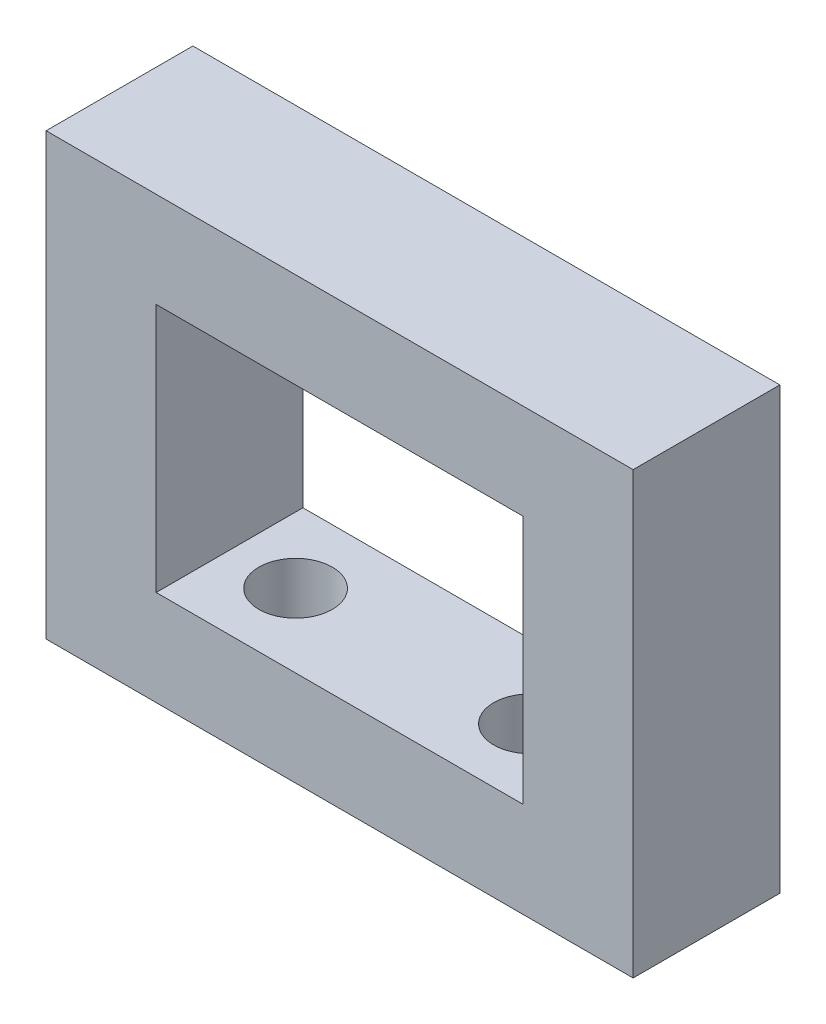
ISO-10303-21;
HEADER;
FILE_DESCRIPTION(('STEP AP214'),'2;1');
FILE_NAME('part.step','',(''),(''),'','','');
FILE_SCHEMA(('AUTOMOTIVE_DESIGN { 1 0 10303 214 1 1 1 1 }'));
ENDSEC;
DATA;
#1=APPLICATION_CONTEXT('core data for automotive mechanical design processes');
#2=APPLICATION_PROTOCOL_DEFINITION('international standard','automotive_design',2000,#1);
#3=PRODUCT_CONTEXT('',#1,'mechanical');
#4=PRODUCT('Part','Part','',(#3));
#5=PRODUCT_RELATED_PRODUCT_CATEGORY('part','',(#4));
#6=PRODUCT_DEFINITION_FORMATION('','',#4);
#7=PRODUCT_DEFINITION_CONTEXT('part definition',#1,'design');
#8=PRODUCT_DEFINITION('design','',#6,#7);
#9=PRODUCT_DEFINITION_SHAPE('','',#8);
#10=(LENGTH_UNIT() NAMED_UNIT(*) SI_UNIT(.MILLI.,.METRE.));
#11=(NAMED_UNIT(*) PLANE_ANGLE_UNIT() SI_UNIT($,.RADIAN.));
#12=(NAMED_UNIT(*) SI_UNIT($,.STERADIAN.) SOLID_ANGLE_UNIT());
#13=UNCERTAINTY_MEASURE_WITH_UNIT(LENGTH_MEASURE(1.E-05),#10,'distance_accuracy_value','');
#14=(GEOMETRIC_REPRESENTATION_CONTEXT(3) GLOBAL_UNCERTAINTY_ASSIGNED_CONTEXT((#13)) GLOBAL_UNIT_ASSIGNED_CONTEXT((#10,
#11,#12)) REPRESENTATION_CONTEXT('',''));
#15=CARTESIAN_POINT('',(0.,0.,0.));
#16=DIRECTION('',(0.,0.,1.));
#17=DIRECTION('',(1.,0.,0.));
#18=AXIS2_PLACEMENT_3D('',#15,#16,#17);
#19=CARTESIAN_POINT('',(10.,-7.5,2.5));
#20=DIRECTION('',(-1.,0.,0.));
#21=DIRECTION('',(0.,0.,1.));
#22=AXIS2_PLACEMENT_3D('',#19,#20,#21);
#23=PLANE('',#22);
#24=DIRECTION('',(0.,1.,0.));
#25=VECTOR('',#24,1.);
#26=CARTESIAN_POINT('',(10.,-7.5,-2.5));
#27=LINE('',#26,#25);
#28=CARTESIAN_POINT('',(10.,-7.5,-2.5));
#29=VERTEX_POINT('',#28);
#30=CARTESIAN_POINT('',(10.,7.5,-2.5));
#31=VERTEX_POINT('',#30);
#32=EDGE_CURVE('E134',#29,#31,#27,.T.);
#33=ORIENTED_EDGE('',*,*,#32,.T.);
#34=DIRECTION('',(0.,0.,-1.));
#35=VECTOR('',#34,1.);
#36=CARTESIAN_POINT('',(10.,7.5,2.5));
#37=LINE('',#36,#35);
#38=CARTESIAN_POINT('',(10.,7.5,2.5));
#39=VERTEX_POINT('',#38);
#40=EDGE_CURVE('E11',#39,#31,#37,.T.);
#41=ORIENTED_EDGE('',*,*,#40,.F.);
#42=DIRECTION('',(0.,1.,0.));
#43=VECTOR('',#42,1.);
#44=CARTESIAN_POINT('',(10.,-7.5,2.5));
#45=LINE('',#44,#43);
#46=CARTESIAN_POINT('',(10.,-7.5,2.5));
#47=VERTEX_POINT('',#46);
#48=EDGE_CURVE('E138',#47,#39,#45,.T.);
#49=ORIENTED_EDGE('',*,*,#48,.F.);
#50=DIRECTION('',(0.,0.,-1.));
#51=VECTOR('',#50,1.);
#52=CARTESIAN_POINT('',(10.,-7.5,2.5));
#53=LINE('',#52,#51);
#54=EDGE_CURVE('E148',#47,#29,#53,.T.);
#55=ORIENTED_EDGE('',*,*,#54,.T.);
#56=EDGE_LOOP('',(#33,#41,#49,#55));
#57=FACE_BOUND('',#56,.T.);
#58=ADVANCED_FACE('F33',(#57),#23,.F.);
#59=CARTESIAN_POINT('',(-9.99999999999999,7.5,2.5));
#60=DIRECTION('',(0.,-1.,0.));
#61=DIRECTION('',(0.,0.,-1.));
#62=AXIS2_PLACEMENT_3D('',#59,#60,#61);
#63=PLANE('',#62);
#64=DIRECTION('',(-1.,0.,0.));
#65=VECTOR('',#64,1.);
#66=CARTESIAN_POINT('',(-9.99999999999999,7.5,-2.5));
#67=LINE('',#66,#65);
#68=CARTESIAN_POINT('',(-9.99999999999999,7.5,-2.5));
#69=VERTEX_POINT('',#68);
#70=EDGE_CURVE('E151',#31,#69,#67,.T.);
#71=ORIENTED_EDGE('',*,*,#70,.T.);
#72=DIRECTION('',(0.,0.,-1.));
#73=VECTOR('',#72,1.);
#74=CARTESIAN_POINT('',(-9.99999999999999,7.5,2.5));
#75=LINE('',#74,#73);
#76=CARTESIAN_POINT('',(-9.99999999999999,7.5,2.5));
#77=VERTEX_POINT('',#76);
#78=EDGE_CURVE('E40',#77,#69,#75,.T.);
#79=ORIENTED_EDGE('',*,*,#78,.F.);
#80=DIRECTION('',(-1.,0.,0.));
#81=VECTOR('',#80,1.);
#82=CARTESIAN_POINT('',(-9.99999999999999,7.5,2.5));
#83=LINE('',#82,#81);
#84=EDGE_CURVE('E141',#39,#77,#83,.T.);
#85=ORIENTED_EDGE('',*,*,#84,.F.);
#86=ORIENTED_EDGE('',*,*,#40,.T.);
#87=EDGE_LOOP('',(#71,#79,#85,#86));
#88=FACE_BOUND('',#87,.T.);
#89=ADVANCED_FACE('F179',(#88),#63,.F.);
#90=CARTESIAN_POINT('',(-9.99999999999999,-7.5,2.5));
#91=DIRECTION('',(1.,0.,0.));
#92=DIRECTION('',(0.,0.,-1.));
#93=AXIS2_PLACEMENT_3D('',#90,#91,#92);
#94=PLANE('',#93);
#95=DIRECTION('',(0.,-1.,0.));
#96=VECTOR('',#95,1.);
#97=CARTESIAN_POINT('',(-9.99999999999999,-7.5,-2.5));
#98=LINE('',#97,#96);
#99=CARTESIAN_POINT('',(-9.99999999999999,-7.5,-2.5));
#100=VERTEX_POINT('',#99);
#101=EDGE_CURVE('E153',#69,#100,#98,.T.);
#102=ORIENTED_EDGE('',*,*,#101,.T.);
#103=DIRECTION('',(0.,0.,-1.));
#104=VECTOR('',#103,1.);
#105=CARTESIAN_POINT('',(-9.99999999999999,-7.5,2.5));
#106=LINE('',#105,#104);
#107=CARTESIAN_POINT('',(-9.99999999999999,-7.5,2.5));
#108=VERTEX_POINT('',#107);
#109=EDGE_CURVE('E158',#108,#100,#106,.T.);
#110=ORIENTED_EDGE('',*,*,#109,.F.);
#111=DIRECTION('',(0.,-1.,0.));
#112=VECTOR('',#111,1.);
#113=CARTESIAN_POINT('',(-9.99999999999999,-7.5,2.5));
#114=LINE('',#113,#112);
#115=EDGE_CURVE('E144',#77,#108,#114,.T.);
#116=ORIENTED_EDGE('',*,*,#115,.F.);
#117=ORIENTED_EDGE('',*,*,#78,.T.);
#118=EDGE_LOOP('',(#102,#110,#116,#117));
#119=FACE_BOUND('',#118,.T.);
#120=ADVANCED_FACE('F165',(#119),#94,.F.);
#121=CARTESIAN_POINT('',(-9.99999999999999,-7.5,2.5));
#122=DIRECTION('',(0.,1.,0.));
#123=DIRECTION('',(0.,0.,1.));
#124=AXIS2_PLACEMENT_3D('',#121,#122,#123);
#125=PLANE('',#124);
#126=CARTESIAN_POINT('',(-4.,-7.5,0.));
#127=DIRECTION('',(0.,-1.,0.));
#128=DIRECTION('',(0.,0.,-1.));
#129=AXIS2_PLACEMENT_3D('',#126,#127,#128);
#130=CIRCLE('',#129,1.25);
#131=CARTESIAN_POINT('',(-4.,-7.5,-1.25));
#132=VERTEX_POINT('',#131);
#133=EDGE_CURVE('E218',#132,#132,#130,.T.);
#134=ORIENTED_EDGE('',*,*,#133,.F.);
#135=EDGE_LOOP('',(#134));
#136=FACE_BOUND('',#135,.T.);
#137=CARTESIAN_POINT('',(4.,-7.5,0.));
#138=DIRECTION('',(0.,-1.,0.));
#139=DIRECTION('',(0.,0.,-1.));
#140=AXIS2_PLACEMENT_3D('',#137,#138,#139);
#141=CIRCLE('',#140,1.25);
#142=CARTESIAN_POINT('',(4.,-7.5,-1.25));
#143=VERTEX_POINT('',#142);
#144=EDGE_CURVE('E223',#143,#143,#141,.T.);
#145=ORIENTED_EDGE('',*,*,#144,.F.);
#146=EDGE_LOOP('',(#145));
#147=FACE_BOUND('',#146,.T.);
#148=DIRECTION('',(1.,0.,0.));
#149=VECTOR('',#148,1.);
#150=CARTESIAN_POINT('',(-9.99999999999999,-7.5,-2.5));
#151=LINE('',#150,#149);
#152=EDGE_CURVE('E142',#100,#29,#151,.T.);
#153=ORIENTED_EDGE('',*,*,#152,.T.);
#154=ORIENTED_EDGE('',*,*,#54,.F.);
#155=DIRECTION('',(1.,0.,0.));
#156=VECTOR('',#155,1.);
#157=CARTESIAN_POINT('',(-9.99999999999999,-7.5,2.5));
#158=LINE('',#157,#156);
#159=EDGE_CURVE('E146',#108,#47,#158,.T.);
#160=ORIENTED_EDGE('',*,*,#159,.F.);
#161=ORIENTED_EDGE('',*,*,#109,.T.);
#162=EDGE_LOOP('',(#153,#154,#160,#161));
#163=FACE_BOUND('',#162,.T.);
#164=ADVANCED_FACE('F172',(#136,#147,#163),#125,.F.);
#165=CARTESIAN_POINT('',(0.,0.,2.5));
#166=DIRECTION('',(0.,0.,-1.));
#167=DIRECTION('',(-1.,0.,0.));
#168=AXIS2_PLACEMENT_3D('',#165,#166,#167);
#169=PLANE('',#168);
#170=DIRECTION('',(-1.,0.,0.));
#171=VECTOR('',#170,1.);
#172=CARTESIAN_POINT('',(-6.25,4.25,2.5));
#173=LINE('',#172,#171);
#174=CARTESIAN_POINT('',(6.25,4.25,2.5));
#175=VERTEX_POINT('',#174);
#176=CARTESIAN_POINT('',(-6.25,4.25,2.5));
#177=VERTEX_POINT('',#176);
#178=EDGE_CURVE('E127',#175,#177,#173,.T.);
#179=ORIENTED_EDGE('',*,*,#178,.F.);
#180=DIRECTION('',(0.,1.,0.));
#181=VECTOR('',#180,1.);
#182=CARTESIAN_POINT('',(6.25,-4.25,2.5));
#183=LINE('',#182,#181);
#184=CARTESIAN_POINT('',(6.25,-4.25,2.5));
#185=VERTEX_POINT('',#184);
#186=EDGE_CURVE('E47',#185,#175,#183,.T.);
#187=ORIENTED_EDGE('',*,*,#186,.F.);
#188=DIRECTION('',(1.,0.,0.));
#189=VECTOR('',#188,1.);
#190=CARTESIAN_POINT('',(-6.25,-4.25,2.5));
#191=LINE('',#190,#189);
#192=CARTESIAN_POINT('',(-6.25,-4.25,2.5));
#193=VERTEX_POINT('',#192);
#194=EDGE_CURVE('E115',#193,#185,#191,.T.);
#195=ORIENTED_EDGE('',*,*,#194,.F.);
#196=DIRECTION('',(0.,-1.,0.));
#197=VECTOR('',#196,1.);
#198=CARTESIAN_POINT('',(-6.25,-4.25,2.5));
#199=LINE('',#198,#197);
#200=EDGE_CURVE('E118',#177,#193,#199,.T.);
#201=ORIENTED_EDGE('',*,*,#200,.F.);
#202=EDGE_LOOP('',(#179,#187,#195,#201));
#203=FACE_BOUND('',#202,.T.);
#204=ORIENTED_EDGE('',*,*,#48,.T.);
#205=ORIENTED_EDGE('',*,*,#84,.T.);
#206=ORIENTED_EDGE('',*,*,#115,.T.);
#207=ORIENTED_EDGE('',*,*,#159,.T.);
#208=EDGE_LOOP('',(#204,#205,#206,#207));
#209=FACE_BOUND('',#208,.T.);
#210=ADVANCED_FACE('F178',(#203,#209),#169,.F.);
#211=CARTESIAN_POINT('',(0.,0.,-2.5));
#212=DIRECTION('',(0.,0.,-1.));
#213=DIRECTION('',(-1.,0.,0.));
#214=AXIS2_PLACEMENT_3D('',#211,#212,#213);
#215=PLANE('',#214);
#216=DIRECTION('',(0.,1.,0.));
#217=VECTOR('',#216,1.);
#218=CARTESIAN_POINT('',(6.25,-4.25,-2.5));
#219=LINE('',#218,#217);
#220=CARTESIAN_POINT('',(6.25,-4.25,-2.5));
#221=VERTEX_POINT('',#220);
#222=CARTESIAN_POINT('',(6.25,4.25,-2.5));
#223=VERTEX_POINT('',#222);
#224=EDGE_CURVE('E99',#221,#223,#219,.T.);
#225=ORIENTED_EDGE('',*,*,#224,.T.);
#226=DIRECTION('',(-1.,0.,0.));
#227=VECTOR('',#226,1.);
#228=CARTESIAN_POINT('',(-6.25,4.25,-2.5));
#229=LINE('',#228,#227);
#230=CARTESIAN_POINT('',(-6.25,4.25,-2.5));
#231=VERTEX_POINT('',#230);
#232=EDGE_CURVE('E108',#223,#231,#229,.T.);
#233=ORIENTED_EDGE('',*,*,#232,.T.);
#234=DIRECTION('',(0.,-1.,0.));
#235=VECTOR('',#234,1.);
#236=CARTESIAN_POINT('',(-6.25,-4.25,-2.5));
#237=LINE('',#236,#235);
#238=CARTESIAN_POINT('',(-6.25,-4.25,-2.5));
#239=VERTEX_POINT('',#238);
#240=EDGE_CURVE('E55',#231,#239,#237,.T.);
#241=ORIENTED_EDGE('',*,*,#240,.T.);
#242=DIRECTION('',(1.,0.,0.));
#243=VECTOR('',#242,1.);
#244=CARTESIAN_POINT('',(-6.25,-4.25,-2.5));
#245=LINE('',#244,#243);
#246=EDGE_CURVE('E105',#239,#221,#245,.T.);
#247=ORIENTED_EDGE('',*,*,#246,.T.);
#248=EDGE_LOOP('',(#225,#233,#241,#247));
#249=FACE_BOUND('',#248,.T.);
#250=ORIENTED_EDGE('',*,*,#32,.F.);
#251=ORIENTED_EDGE('',*,*,#152,.F.);
#252=ORIENTED_EDGE('',*,*,#101,.F.);
#253=ORIENTED_EDGE('',*,*,#70,.F.);
#254=EDGE_LOOP('',(#250,#251,#252,#253));
#255=FACE_BOUND('',#254,.T.);
#256=ADVANCED_FACE('F112',(#249,#255),#215,.T.);
#257=CARTESIAN_POINT('',(6.25,-4.25,-2.5));
#258=DIRECTION('',(1.,0.,0.));
#259=DIRECTION('',(0.,0.,-1.));
#260=AXIS2_PLACEMENT_3D('',#257,#258,#259);
#261=PLANE('',#260);
#262=ORIENTED_EDGE('',*,*,#186,.T.);
#263=DIRECTION('',(0.,0.,1.));
#264=VECTOR('',#263,1.);
#265=CARTESIAN_POINT('',(6.25,4.25,-2.5));
#266=LINE('',#265,#264);
#267=EDGE_CURVE('E95',#223,#175,#266,.T.);
#268=ORIENTED_EDGE('',*,*,#267,.F.);
#269=ORIENTED_EDGE('',*,*,#224,.F.);
#270=DIRECTION('',(0.,0.,1.));
#271=VECTOR('',#270,1.);
#272=CARTESIAN_POINT('',(6.25,-4.25,-2.5));
#273=LINE('',#272,#271);
#274=EDGE_CURVE('E132',#221,#185,#273,.T.);
#275=ORIENTED_EDGE('',*,*,#274,.T.);
#276=EDGE_LOOP('',(#262,#268,#269,#275));
#277=FACE_BOUND('',#276,.T.);
#278=ADVANCED_FACE('F97',(#277),#261,.F.);
#279=CARTESIAN_POINT('',(-6.25,-4.25,-2.5));
#280=DIRECTION('',(0.,-1.,0.));
#281=DIRECTION('',(0.,0.,-1.));
#282=AXIS2_PLACEMENT_3D('',#279,#280,#281);
#283=PLANE('',#282);
#284=CARTESIAN_POINT('',(-4.,-4.25,0.));
#285=DIRECTION('',(0.,-1.,0.));
#286=DIRECTION('',(0.,0.,-1.));
#287=AXIS2_PLACEMENT_3D('',#284,#285,#286);
#288=CIRCLE('',#287,1.25);
#289=CARTESIAN_POINT('',(-4.,-4.25,-1.25));
#290=VERTEX_POINT('',#289);
#291=EDGE_CURVE('E128',#290,#290,#288,.F.);
#292=ORIENTED_EDGE('',*,*,#291,.F.);
#293=EDGE_LOOP('',(#292));
#294=FACE_BOUND('',#293,.T.);
#295=CARTESIAN_POINT('',(4.,-4.25,0.));
#296=DIRECTION('',(0.,-1.,0.));
#297=DIRECTION('',(0.,0.,-1.));
#298=AXIS2_PLACEMENT_3D('',#295,#296,#297);
#299=CIRCLE('',#298,1.25);
#300=CARTESIAN_POINT('',(4.,-4.25,-1.25));
#301=VERTEX_POINT('',#300);
#302=EDGE_CURVE('E121',#301,#301,#299,.F.);
#303=ORIENTED_EDGE('',*,*,#302,.F.);
#304=EDGE_LOOP('',(#303));
#305=FACE_BOUND('',#304,.T.);
#306=ORIENTED_EDGE('',*,*,#194,.T.);
#307=ORIENTED_EDGE('',*,*,#274,.F.);
#308=ORIENTED_EDGE('',*,*,#246,.F.);
#309=DIRECTION('',(0.,0.,1.));
#310=VECTOR('',#309,1.);
#311=CARTESIAN_POINT('',(-6.25,-4.25,-2.5));
#312=LINE('',#311,#310);
#313=EDGE_CURVE('E135',#239,#193,#312,.T.);
#314=ORIENTED_EDGE('',*,*,#313,.T.);
#315=EDGE_LOOP('',(#306,#307,#308,#314));
#316=FACE_BOUND('',#315,.T.);
#317=ADVANCED_FACE('F197',(#294,#305,#316),#283,.F.);
#318=CARTESIAN_POINT('',(-6.25,-4.25,-2.5));
#319=DIRECTION('',(-1.,0.,0.));
#320=DIRECTION('',(0.,0.,1.));
#321=AXIS2_PLACEMENT_3D('',#318,#319,#320);
#322=PLANE('',#321);
#323=ORIENTED_EDGE('',*,*,#200,.T.);
#324=ORIENTED_EDGE('',*,*,#313,.F.);
#325=ORIENTED_EDGE('',*,*,#240,.F.);
#326=DIRECTION('',(0.,0.,1.));
#327=VECTOR('',#326,1.);
#328=CARTESIAN_POINT('',(-6.25,4.25,-2.5));
#329=LINE('',#328,#327);
#330=EDGE_CURVE('E104',#231,#177,#329,.T.);
#331=ORIENTED_EDGE('',*,*,#330,.T.);
#332=EDGE_LOOP('',(#323,#324,#325,#331));
#333=FACE_BOUND('',#332,.T.);
#334=ADVANCED_FACE('F201',(#333),#322,.F.);
#335=CARTESIAN_POINT('',(-6.25,4.25,-2.5));
#336=DIRECTION('',(0.,1.,0.));
#337=DIRECTION('',(0.,0.,1.));
#338=AXIS2_PLACEMENT_3D('',#335,#336,#337);
#339=PLANE('',#338);
#340=ORIENTED_EDGE('',*,*,#178,.T.);
#341=ORIENTED_EDGE('',*,*,#330,.F.);
#342=ORIENTED_EDGE('',*,*,#232,.F.);
#343=ORIENTED_EDGE('',*,*,#267,.T.);
#344=EDGE_LOOP('',(#340,#341,#342,#343));
#345=FACE_BOUND('',#344,.T.);
#346=ADVANCED_FACE('F109',(#345),#339,.F.);
#347=CARTESIAN_POINT('',(4.,7.501,0.));
#348=DIRECTION('',(0.,-1.,0.));
#349=DIRECTION('',(0.,0.,-1.));
#350=AXIS2_PLACEMENT_3D('',#347,#348,#349);
#351=CYLINDRICAL_SURFACE('',#350,1.25);
#352=ORIENTED_EDGE('',*,*,#144,.T.);
#353=EDGE_LOOP('',(#352));
#354=FACE_BOUND('',#353,.T.);
#355=ORIENTED_EDGE('',*,*,#302,.T.);
#356=EDGE_LOOP('',(#355));
#357=FACE_BOUND('',#356,.T.);
#358=ADVANCED_FACE('F200',(#354,#357),#351,.F.);
#359=CARTESIAN_POINT('',(-4.,7.501,0.));
#360=DIRECTION('',(0.,-1.,0.));
#361=DIRECTION('',(0.,0.,-1.));
#362=AXIS2_PLACEMENT_3D('',#359,#360,#361);
#363=CYLINDRICAL_SURFACE('',#362,1.25);
#364=ORIENTED_EDGE('',*,*,#133,.T.);
#365=EDGE_LOOP('',(#364));
#366=FACE_BOUND('',#365,.T.);
#367=ORIENTED_EDGE('',*,*,#291,.T.);
#368=EDGE_LOOP('',(#367));
#369=FACE_BOUND('',#368,.T.);
#370=ADVANCED_FACE('F209',(#366,#369),#363,.F.);
#371=CLOSED_SHELL('',(#58,#89,#120,#164,#210,#256,#278,#317,#334,#346,#358,#370));
#372=MANIFOLD_SOLID_BREP('B2',#371);
#373=ADVANCED_BREP_SHAPE_REPRESENTATION('',(#18,#372),#14);
#374=SHAPE_DEFINITION_REPRESENTATION(#9,#373);
ENDSEC;
END-ISO-10303-21;
